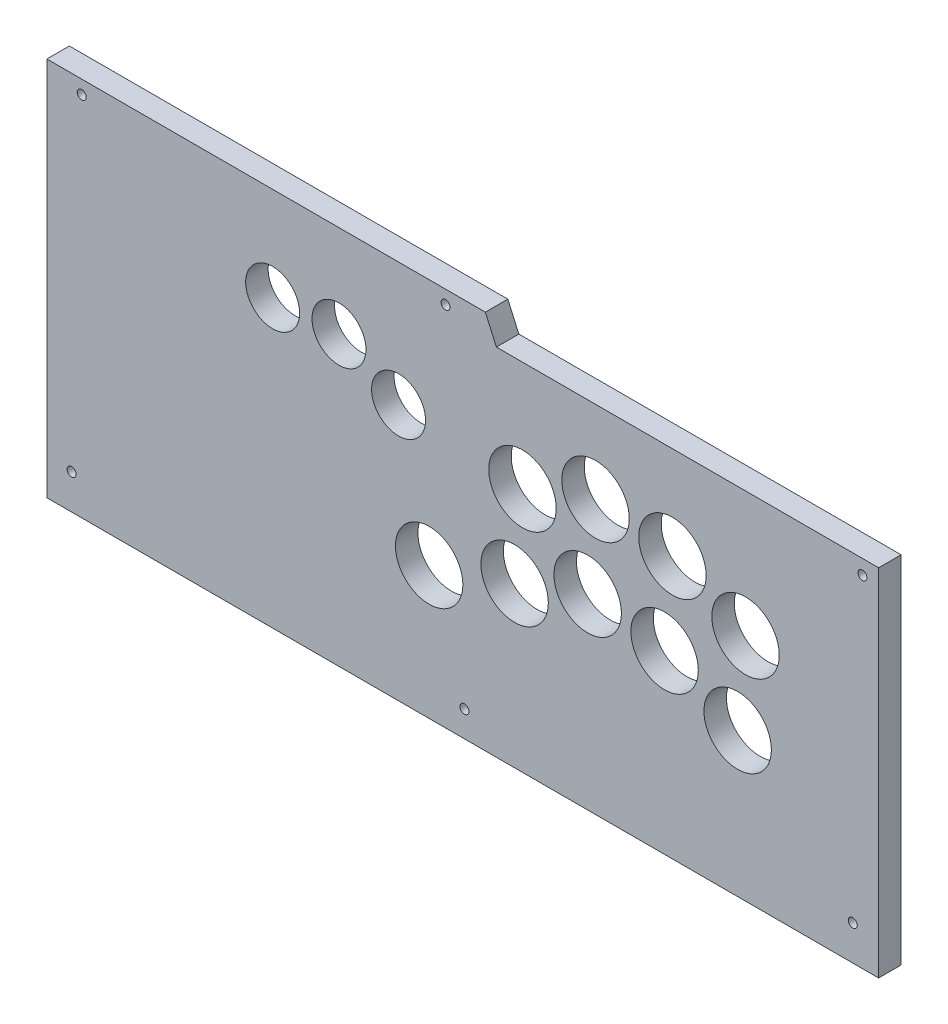
ISO-10303-21;
HEADER;
FILE_DESCRIPTION(('STEP AP214'),'2;1');
FILE_NAME('part.step','',(''),(''),'','','');
FILE_SCHEMA(('AUTOMOTIVE_DESIGN { 1 0 10303 214 1 1 1 1 }'));
ENDSEC;
DATA;
#1=APPLICATION_CONTEXT('core data for automotive mechanical design processes');
#2=APPLICATION_PROTOCOL_DEFINITION('international standard','automotive_design',2000,#1);
#3=PRODUCT_CONTEXT('',#1,'mechanical');
#4=PRODUCT('Part','Part','',(#3));
#5=PRODUCT_RELATED_PRODUCT_CATEGORY('part','',(#4));
#6=PRODUCT_DEFINITION_FORMATION('','',#4);
#7=PRODUCT_DEFINITION_CONTEXT('part definition',#1,'design');
#8=PRODUCT_DEFINITION('design','',#6,#7);
#9=PRODUCT_DEFINITION_SHAPE('','',#8);
#10=(LENGTH_UNIT() NAMED_UNIT(*) SI_UNIT(.MILLI.,.METRE.));
#11=(NAMED_UNIT(*) PLANE_ANGLE_UNIT() SI_UNIT($,.RADIAN.));
#12=(NAMED_UNIT(*) SI_UNIT($,.STERADIAN.) SOLID_ANGLE_UNIT());
#13=UNCERTAINTY_MEASURE_WITH_UNIT(LENGTH_MEASURE(1.E-05),#10,'distance_accuracy_value','');
#14=(GEOMETRIC_REPRESENTATION_CONTEXT(3) GLOBAL_UNCERTAINTY_ASSIGNED_CONTEXT((#13)) GLOBAL_UNIT_ASSIGNED_CONTEXT((#10,
#11,#12)) REPRESENTATION_CONTEXT('',''));
#15=CARTESIAN_POINT('',(0.,0.,0.));
#16=DIRECTION('',(0.,0.,1.));
#17=DIRECTION('',(1.,0.,0.));
#18=AXIS2_PLACEMENT_3D('',#15,#16,#17);
#19=CARTESIAN_POINT('',(184.95,0.,5.));
#20=DIRECTION('',(-1.,0.,0.));
#21=DIRECTION('',(0.,0.,1.));
#22=AXIS2_PLACEMENT_3D('',#19,#20,#21);
#23=PLANE('',#22);
#24=DIRECTION('',(0.,1.,0.));
#25=VECTOR('',#24,1.);
#26=CARTESIAN_POINT('',(184.95,0.,-5.));
#27=LINE('',#26,#25);
#28=CARTESIAN_POINT('',(184.95,0.,-5.));
#29=VERTEX_POINT('',#28);
#30=CARTESIAN_POINT('',(184.95,158.,-5.));
#31=VERTEX_POINT('',#30);
#32=EDGE_CURVE('E128',#29,#31,#27,.T.);
#33=ORIENTED_EDGE('',*,*,#32,.T.);
#34=DIRECTION('',(0.,0.,-1.));
#35=VECTOR('',#34,1.);
#36=CARTESIAN_POINT('',(184.95,158.,5.));
#37=LINE('',#36,#35);
#38=CARTESIAN_POINT('',(184.95,158.,5.));
#39=VERTEX_POINT('',#38);
#40=EDGE_CURVE('E11',#39,#31,#37,.T.);
#41=ORIENTED_EDGE('',*,*,#40,.F.);
#42=DIRECTION('',(0.,1.,0.));
#43=VECTOR('',#42,1.);
#44=CARTESIAN_POINT('',(184.95,0.,5.));
#45=LINE('',#44,#43);
#46=CARTESIAN_POINT('',(184.95,0.,5.));
#47=VERTEX_POINT('',#46);
#48=EDGE_CURVE('E145',#47,#39,#45,.T.);
#49=ORIENTED_EDGE('',*,*,#48,.F.);
#50=DIRECTION('',(0.,0.,-1.));
#51=VECTOR('',#50,1.);
#52=CARTESIAN_POINT('',(184.95,0.,5.));
#53=LINE('',#52,#51);
#54=EDGE_CURVE('E124',#47,#29,#53,.T.);
#55=ORIENTED_EDGE('',*,*,#54,.T.);
#56=EDGE_LOOP('',(#33,#41,#49,#55));
#57=FACE_BOUND('',#56,.T.);
#58=ADVANCED_FACE('F39',(#57),#23,.F.);
#59=CARTESIAN_POINT('',(184.95,158.,5.));
#60=DIRECTION('',(0.,-1.,0.));
#61=DIRECTION('',(1.,0.,0.));
#62=AXIS2_PLACEMENT_3D('',#59,#60,#61);
#63=PLANE('',#62);
#64=DIRECTION('',(-1.,0.,0.));
#65=VECTOR('',#64,1.);
#66=CARTESIAN_POINT('',(184.95,158.,-5.));
#67=LINE('',#66,#65);
#68=CARTESIAN_POINT('',(14.9499999999999,158.,-5.));
#69=VERTEX_POINT('',#68);
#70=EDGE_CURVE('E132',#31,#69,#67,.T.);
#71=ORIENTED_EDGE('',*,*,#70,.T.);
#72=DIRECTION('',(0.,0.,-1.));
#73=VECTOR('',#72,1.);
#74=CARTESIAN_POINT('',(14.9499999999999,158.,5.));
#75=LINE('',#74,#73);
#76=CARTESIAN_POINT('',(14.9499999999999,158.,5.));
#77=VERTEX_POINT('',#76);
#78=EDGE_CURVE('E48',#77,#69,#75,.T.);
#79=ORIENTED_EDGE('',*,*,#78,.F.);
#80=DIRECTION('',(-1.,0.,0.));
#81=VECTOR('',#80,1.);
#82=CARTESIAN_POINT('',(184.95,158.,5.));
#83=LINE('',#82,#81);
#84=EDGE_CURVE('E93',#39,#77,#83,.T.);
#85=ORIENTED_EDGE('',*,*,#84,.F.);
#86=ORIENTED_EDGE('',*,*,#40,.T.);
#87=EDGE_LOOP('',(#71,#79,#85,#86));
#88=FACE_BOUND('',#87,.T.);
#89=ADVANCED_FACE('F174',(#88),#63,.F.);
#90=CARTESIAN_POINT('',(14.9499999999999,158.,5.));
#91=DIRECTION('',(-0.91346878001076,-0.406908820186603,0.));
#92=DIRECTION('',(0.406908820186603,-0.91346878001076,0.));
#93=AXIS2_PLACEMENT_3D('',#90,#91,#92);
#94=PLANE('',#93);
#95=DIRECTION('',(-0.406908820186603,0.91346878001076,0.));
#96=VECTOR('',#95,1.);
#97=CARTESIAN_POINT('',(14.9499999999999,158.,-5.));
#98=LINE('',#97,#96);
#99=CARTESIAN_POINT('',(10.05,169.,-5.));
#100=VERTEX_POINT('',#99);
#101=EDGE_CURVE('E136',#69,#100,#98,.T.);
#102=ORIENTED_EDGE('',*,*,#101,.T.);
#103=DIRECTION('',(0.,0.,-1.));
#104=VECTOR('',#103,1.);
#105=CARTESIAN_POINT('',(10.05,169.,5.));
#106=LINE('',#105,#104);
#107=CARTESIAN_POINT('',(10.05,169.,5.));
#108=VERTEX_POINT('',#107);
#109=EDGE_CURVE('E117',#108,#100,#106,.T.);
#110=ORIENTED_EDGE('',*,*,#109,.F.);
#111=DIRECTION('',(-0.406908820186603,0.91346878001076,0.));
#112=VECTOR('',#111,1.);
#113=CARTESIAN_POINT('',(14.9499999999999,158.,5.));
#114=LINE('',#113,#112);
#115=EDGE_CURVE('E106',#77,#108,#114,.T.);
#116=ORIENTED_EDGE('',*,*,#115,.F.);
#117=ORIENTED_EDGE('',*,*,#78,.T.);
#118=EDGE_LOOP('',(#102,#110,#116,#117));
#119=FACE_BOUND('',#118,.T.);
#120=ADVANCED_FACE('F155',(#119),#94,.F.);
#121=CARTESIAN_POINT('',(10.05,169.,5.));
#122=DIRECTION('',(0.,-1.,0.));
#123=DIRECTION('',(1.,0.,0.));
#124=AXIS2_PLACEMENT_3D('',#121,#122,#123);
#125=PLANE('',#124);
#126=DIRECTION('',(-1.,0.,0.));
#127=VECTOR('',#126,1.);
#128=CARTESIAN_POINT('',(10.05,169.,-5.));
#129=LINE('',#128,#127);
#130=CARTESIAN_POINT('',(-184.95,169.,-5.));
#131=VERTEX_POINT('',#130);
#132=EDGE_CURVE('E115',#100,#131,#129,.T.);
#133=ORIENTED_EDGE('',*,*,#132,.T.);
#134=DIRECTION('',(0.,0.,-1.));
#135=VECTOR('',#134,1.);
#136=CARTESIAN_POINT('',(-184.95,169.,5.));
#137=LINE('',#136,#135);
#138=CARTESIAN_POINT('',(-184.95,169.,5.));
#139=VERTEX_POINT('',#138);
#140=EDGE_CURVE('E112',#139,#131,#137,.T.);
#141=ORIENTED_EDGE('',*,*,#140,.F.);
#142=DIRECTION('',(-1.,0.,0.));
#143=VECTOR('',#142,1.);
#144=CARTESIAN_POINT('',(10.05,169.,5.));
#145=LINE('',#144,#143);
#146=EDGE_CURVE('E100',#108,#139,#145,.T.);
#147=ORIENTED_EDGE('',*,*,#146,.F.);
#148=ORIENTED_EDGE('',*,*,#109,.T.);
#149=EDGE_LOOP('',(#133,#141,#147,#148));
#150=FACE_BOUND('',#149,.T.);
#151=ADVANCED_FACE('F113',(#150),#125,.F.);
#152=CARTESIAN_POINT('',(-184.95,169.,5.));
#153=DIRECTION('',(1.,0.,0.));
#154=DIRECTION('',(0.,1.,0.));
#155=AXIS2_PLACEMENT_3D('',#152,#153,#154);
#156=PLANE('',#155);
#157=DIRECTION('',(0.,-1.,0.));
#158=VECTOR('',#157,1.);
#159=CARTESIAN_POINT('',(-184.95,169.,-5.));
#160=LINE('',#159,#158);
#161=CARTESIAN_POINT('',(-184.95,0.,-5.));
#162=VERTEX_POINT('',#161);
#163=EDGE_CURVE('E79',#131,#162,#160,.T.);
#164=ORIENTED_EDGE('',*,*,#163,.T.);
#165=DIRECTION('',(0.,0.,-1.));
#166=VECTOR('',#165,1.);
#167=CARTESIAN_POINT('',(-184.95,0.,5.));
#168=LINE('',#167,#166);
#169=CARTESIAN_POINT('',(-184.95,0.,5.));
#170=VERTEX_POINT('',#169);
#171=EDGE_CURVE('E118',#170,#162,#168,.T.);
#172=ORIENTED_EDGE('',*,*,#171,.F.);
#173=DIRECTION('',(0.,-1.,0.));
#174=VECTOR('',#173,1.);
#175=CARTESIAN_POINT('',(-184.95,169.,5.));
#176=LINE('',#175,#174);
#177=EDGE_CURVE('E104',#139,#170,#176,.T.);
#178=ORIENTED_EDGE('',*,*,#177,.F.);
#179=ORIENTED_EDGE('',*,*,#140,.T.);
#180=EDGE_LOOP('',(#164,#172,#178,#179));
#181=FACE_BOUND('',#180,.T.);
#182=ADVANCED_FACE('F120',(#181),#156,.F.);
#183=CARTESIAN_POINT('',(-184.95,0.,5.));
#184=DIRECTION('',(0.,1.,0.));
#185=DIRECTION('',(0.,0.,1.));
#186=AXIS2_PLACEMENT_3D('',#183,#184,#185);
#187=PLANE('',#186);
#188=DIRECTION('',(1.,0.,0.));
#189=VECTOR('',#188,1.);
#190=CARTESIAN_POINT('',(-184.95,0.,-5.));
#191=LINE('',#190,#189);
#192=EDGE_CURVE('E85',#162,#29,#191,.T.);
#193=ORIENTED_EDGE('',*,*,#192,.T.);
#194=ORIENTED_EDGE('',*,*,#54,.F.);
#195=DIRECTION('',(1.,0.,0.));
#196=VECTOR('',#195,1.);
#197=CARTESIAN_POINT('',(-184.95,0.,5.));
#198=LINE('',#197,#196);
#199=EDGE_CURVE('E56',#170,#47,#198,.T.);
#200=ORIENTED_EDGE('',*,*,#199,.F.);
#201=ORIENTED_EDGE('',*,*,#171,.T.);
#202=EDGE_LOOP('',(#193,#194,#200,#201));
#203=FACE_BOUND('',#202,.T.);
#204=ADVANCED_FACE('F162',(#203),#187,.F.);
#205=CARTESIAN_POINT('',(0.,0.,5.));
#206=DIRECTION('',(0.,0.,1.));
#207=DIRECTION('',(1.,0.,0.));
#208=AXIS2_PLACEMENT_3D('',#205,#206,#207);
#209=PLANE('',#208);
#210=CARTESIAN_POINT('',(177.75,151.5,5.));
#211=DIRECTION('',(0.,0.,1.));
#212=DIRECTION('',(1.,0.,0.));
#213=AXIS2_PLACEMENT_3D('',#210,#211,#212);
#214=CIRCLE('',#213,2.);
#215=CARTESIAN_POINT('',(179.75,151.5,5.));
#216=VERTEX_POINT('',#215);
#217=EDGE_CURVE('E400',#216,#216,#214,.T.);
#218=ORIENTED_EDGE('',*,*,#217,.F.);
#219=EDGE_LOOP('',(#218));
#220=FACE_BOUND('',#219,.T.);
#221=CARTESIAN_POINT('',(89.7500000000001,78.4000000000001,5.));
#222=DIRECTION('',(0.,0.,1.));
#223=DIRECTION('',(1.,0.,0.));
#224=AXIS2_PLACEMENT_3D('',#221,#222,#223);
#225=CIRCLE('',#224,15.);
#226=CARTESIAN_POINT('',(104.75,78.4000000000001,5.));
#227=VERTEX_POINT('',#226);
#228=EDGE_CURVE('E454',#227,#227,#225,.T.);
#229=ORIENTED_EDGE('',*,*,#228,.F.);
#230=EDGE_LOOP('',(#229));
#231=FACE_BOUND('',#230,.T.);
#232=CARTESIAN_POINT('',(59.05,121.4,5.));
#233=DIRECTION('',(0.,0.,1.));
#234=DIRECTION('',(1.,0.,0.));
#235=AXIS2_PLACEMENT_3D('',#232,#233,#234);
#236=CIRCLE('',#235,15.);
#237=CARTESIAN_POINT('',(74.05,121.4,5.));
#238=VERTEX_POINT('',#237);
#239=EDGE_CURVE('E462',#238,#238,#236,.T.);
#240=ORIENTED_EDGE('',*,*,#239,.F.);
#241=EDGE_LOOP('',(#240));
#242=FACE_BOUND('',#241,.T.);
#243=CARTESIAN_POINT('',(125.75,102.2,5.));
#244=DIRECTION('',(0.,0.,1.));
#245=DIRECTION('',(1.,0.,0.));
#246=AXIS2_PLACEMENT_3D('',#243,#244,#245);
#247=CIRCLE('',#246,15.);
#248=CARTESIAN_POINT('',(140.75,102.2,5.));
#249=VERTEX_POINT('',#248);
#250=EDGE_CURVE('E470',#249,#249,#247,.T.);
#251=ORIENTED_EDGE('',*,*,#250,.F.);
#252=EDGE_LOOP('',(#251));
#253=FACE_BOUND('',#252,.T.);
#254=CARTESIAN_POINT('',(93.2500000000001,116.6,5.));
#255=DIRECTION('',(0.,0.,1.));
#256=DIRECTION('',(1.,0.,0.));
#257=AXIS2_PLACEMENT_3D('',#254,#255,#256);
#258=CIRCLE('',#257,15.);
#259=CARTESIAN_POINT('',(108.25,116.6,5.));
#260=VERTEX_POINT('',#259);
#261=EDGE_CURVE('E478',#260,#260,#258,.T.);
#262=ORIENTED_EDGE('',*,*,#261,.F.);
#263=EDGE_LOOP('',(#262));
#264=FACE_BOUND('',#263,.T.);
#265=CARTESIAN_POINT('',(26.55,109.2,5.));
#266=DIRECTION('',(0.,0.,1.));
#267=DIRECTION('',(1.,0.,0.));
#268=AXIS2_PLACEMENT_3D('',#265,#266,#267);
#269=CIRCLE('',#268,15.);
#270=CARTESIAN_POINT('',(41.55,109.2,5.));
#271=VERTEX_POINT('',#270);
#272=EDGE_CURVE('E425',#271,#271,#269,.T.);
#273=ORIENTED_EDGE('',*,*,#272,.F.);
#274=EDGE_LOOP('',(#273));
#275=FACE_BOUND('',#274,.T.);
#276=CARTESIAN_POINT('',(23.05,71.0000000000001,5.));
#277=DIRECTION('',(0.,0.,1.));
#278=DIRECTION('',(1.,0.,0.));
#279=AXIS2_PLACEMENT_3D('',#276,#277,#278);
#280=CIRCLE('',#279,15.);
#281=CARTESIAN_POINT('',(38.05,71.0000000000001,5.));
#282=VERTEX_POINT('',#281);
#283=EDGE_CURVE('E432',#282,#282,#280,.T.);
#284=ORIENTED_EDGE('',*,*,#283,.F.);
#285=EDGE_LOOP('',(#284));
#286=FACE_BOUND('',#285,.T.);
#287=CARTESIAN_POINT('',(55.55,83.2000000000001,5.));
#288=DIRECTION('',(0.,0.,1.));
#289=DIRECTION('',(1.,0.,0.));
#290=AXIS2_PLACEMENT_3D('',#287,#288,#289);
#291=CIRCLE('',#290,15.);
#292=CARTESIAN_POINT('',(70.55,83.2000000000001,5.));
#293=VERTEX_POINT('',#292);
#294=EDGE_CURVE('E438',#293,#293,#291,.T.);
#295=ORIENTED_EDGE('',*,*,#294,.F.);
#296=EDGE_LOOP('',(#295));
#297=FACE_BOUND('',#296,.T.);
#298=CARTESIAN_POINT('',(122.25,64.0000000000001,5.));
#299=DIRECTION('',(0.,0.,1.));
#300=DIRECTION('',(1.,0.,0.));
#301=AXIS2_PLACEMENT_3D('',#298,#299,#300);
#302=CIRCLE('',#301,15.);
#303=CARTESIAN_POINT('',(137.25,64.0000000000001,5.));
#304=VERTEX_POINT('',#303);
#305=EDGE_CURVE('E446',#304,#304,#302,.T.);
#306=ORIENTED_EDGE('',*,*,#305,.F.);
#307=EDGE_LOOP('',(#306));
#308=FACE_BOUND('',#307,.T.);
#309=CARTESIAN_POINT('',(173.45,15.5,5.));
#310=DIRECTION('',(0.,0.,1.));
#311=DIRECTION('',(1.,0.,0.));
#312=AXIS2_PLACEMENT_3D('',#309,#310,#311);
#313=CIRCLE('',#312,2.);
#314=CARTESIAN_POINT('',(175.45,15.5,5.));
#315=VERTEX_POINT('',#314);
#316=EDGE_CURVE('E404',#315,#315,#313,.T.);
#317=ORIENTED_EDGE('',*,*,#316,.F.);
#318=EDGE_LOOP('',(#317));
#319=FACE_BOUND('',#318,.T.);
#320=CARTESIAN_POINT('',(0.750000000000049,11.5,5.));
#321=DIRECTION('',(0.,0.,1.));
#322=DIRECTION('',(1.,0.,0.));
#323=AXIS2_PLACEMENT_3D('',#320,#321,#322);
#324=CIRCLE('',#323,2.);
#325=CARTESIAN_POINT('',(2.75000000000005,11.5,5.));
#326=VERTEX_POINT('',#325);
#327=EDGE_CURVE('E534',#326,#326,#324,.T.);
#328=ORIENTED_EDGE('',*,*,#327,.F.);
#329=EDGE_LOOP('',(#328));
#330=FACE_BOUND('',#329,.T.);
#331=CARTESIAN_POINT('',(-173.95,15.5,5.));
#332=DIRECTION('',(0.,0.,1.));
#333=DIRECTION('',(1.,0.,0.));
#334=AXIS2_PLACEMENT_3D('',#331,#332,#333);
#335=CIRCLE('',#334,2.);
#336=CARTESIAN_POINT('',(-171.95,15.5,5.));
#337=VERTEX_POINT('',#336);
#338=EDGE_CURVE('E526',#337,#337,#335,.T.);
#339=ORIENTED_EDGE('',*,*,#338,.F.);
#340=EDGE_LOOP('',(#339));
#341=FACE_BOUND('',#340,.T.);
#342=CARTESIAN_POINT('',(-84.55,127.3,5.));
#343=DIRECTION('',(0.,0.,1.));
#344=DIRECTION('',(1.,0.,0.));
#345=AXIS2_PLACEMENT_3D('',#342,#343,#344);
#346=CIRCLE('',#345,12.);
#347=CARTESIAN_POINT('',(-72.55,127.3,5.));
#348=VERTEX_POINT('',#347);
#349=EDGE_CURVE('E518',#348,#348,#346,.T.);
#350=ORIENTED_EDGE('',*,*,#349,.F.);
#351=EDGE_LOOP('',(#350));
#352=FACE_BOUND('',#351,.T.);
#353=CARTESIAN_POINT('',(-169.45,163.,5.));
#354=DIRECTION('',(0.,0.,1.));
#355=DIRECTION('',(1.,0.,0.));
#356=AXIS2_PLACEMENT_3D('',#353,#354,#355);
#357=CIRCLE('',#356,2.);
#358=CARTESIAN_POINT('',(-167.45,163.,5.));
#359=VERTEX_POINT('',#358);
#360=EDGE_CURVE('E510',#359,#359,#357,.T.);
#361=ORIENTED_EDGE('',*,*,#360,.F.);
#362=EDGE_LOOP('',(#361));
#363=FACE_BOUND('',#362,.T.);
#364=CARTESIAN_POINT('',(-7.64999999999997,163.,5.));
#365=DIRECTION('',(0.,0.,1.));
#366=DIRECTION('',(1.,0.,0.));
#367=AXIS2_PLACEMENT_3D('',#364,#365,#366);
#368=CIRCLE('',#367,2.);
#369=CARTESIAN_POINT('',(-5.64999999999997,163.,5.));
#370=VERTEX_POINT('',#369);
#371=EDGE_CURVE('E502',#370,#370,#368,.T.);
#372=ORIENTED_EDGE('',*,*,#371,.F.);
#373=EDGE_LOOP('',(#372));
#374=FACE_BOUND('',#373,.T.);
#375=CARTESIAN_POINT('',(-55.05,128.,5.));
#376=DIRECTION('',(0.,0.,1.));
#377=DIRECTION('',(1.,0.,0.));
#378=AXIS2_PLACEMENT_3D('',#375,#376,#377);
#379=CIRCLE('',#378,12.);
#380=CARTESIAN_POINT('',(-43.05,128.,5.));
#381=VERTEX_POINT('',#380);
#382=EDGE_CURVE('E494',#381,#381,#379,.T.);
#383=ORIENTED_EDGE('',*,*,#382,.F.);
#384=EDGE_LOOP('',(#383));
#385=FACE_BOUND('',#384,.T.);
#386=CARTESIAN_POINT('',(-28.55,114.,5.));
#387=DIRECTION('',(0.,0.,1.));
#388=DIRECTION('',(1.,0.,0.));
#389=AXIS2_PLACEMENT_3D('',#386,#387,#388);
#390=CIRCLE('',#389,12.);
#391=CARTESIAN_POINT('',(-16.55,114.,5.));
#392=VERTEX_POINT('',#391);
#393=EDGE_CURVE('E486',#392,#392,#390,.T.);
#394=ORIENTED_EDGE('',*,*,#393,.F.);
#395=EDGE_LOOP('',(#394));
#396=FACE_BOUND('',#395,.T.);
#397=CARTESIAN_POINT('',(-14.95,59.,5.));
#398=DIRECTION('',(0.,0.,1.));
#399=DIRECTION('',(1.,0.,0.));
#400=AXIS2_PLACEMENT_3D('',#397,#398,#399);
#401=CIRCLE('',#400,15.);
#402=CARTESIAN_POINT('',(0.0500000000000431,59.,5.));
#403=VERTEX_POINT('',#402);
#404=EDGE_CURVE('E410',#403,#403,#401,.T.);
#405=ORIENTED_EDGE('',*,*,#404,.F.);
#406=EDGE_LOOP('',(#405));
#407=FACE_BOUND('',#406,.T.);
#408=ORIENTED_EDGE('',*,*,#48,.T.);
#409=ORIENTED_EDGE('',*,*,#84,.T.);
#410=ORIENTED_EDGE('',*,*,#115,.T.);
#411=ORIENTED_EDGE('',*,*,#146,.T.);
#412=ORIENTED_EDGE('',*,*,#177,.T.);
#413=ORIENTED_EDGE('',*,*,#199,.T.);
#414=EDGE_LOOP('',(#408,#409,#410,#411,#412,#413));
#415=FACE_BOUND('',#414,.T.);
#416=ADVANCED_FACE('F102',(#220,#231,#242,#253,#264,#275,#286,#297,#308,#319,#330,#341,#352,
#363,#374,#385,#396,#407,#415),#209,.T.);
#417=CARTESIAN_POINT('',(0.,0.,-5.));
#418=DIRECTION('',(0.,0.,1.));
#419=DIRECTION('',(1.,0.,0.));
#420=AXIS2_PLACEMENT_3D('',#417,#418,#419);
#421=PLANE('',#420);
#422=CARTESIAN_POINT('',(177.75,151.5,-5.));
#423=DIRECTION('',(0.,0.,1.));
#424=DIRECTION('',(1.,0.,0.));
#425=AXIS2_PLACEMENT_3D('',#422,#423,#424);
#426=CIRCLE('',#425,2.);
#427=CARTESIAN_POINT('',(179.75,151.5,-5.));
#428=VERTEX_POINT('',#427);
#429=EDGE_CURVE('E397',#428,#428,#426,.T.);
#430=ORIENTED_EDGE('',*,*,#429,.T.);
#431=EDGE_LOOP('',(#430));
#432=FACE_BOUND('',#431,.T.);
#433=CARTESIAN_POINT('',(89.7500000000001,78.4000000000001,-5.));
#434=DIRECTION('',(0.,0.,1.));
#435=DIRECTION('',(1.,0.,0.));
#436=AXIS2_PLACEMENT_3D('',#433,#434,#435);
#437=CIRCLE('',#436,15.);
#438=CARTESIAN_POINT('',(104.75,78.4000000000001,-5.));
#439=VERTEX_POINT('',#438);
#440=EDGE_CURVE('E450',#439,#439,#437,.T.);
#441=ORIENTED_EDGE('',*,*,#440,.T.);
#442=EDGE_LOOP('',(#441));
#443=FACE_BOUND('',#442,.T.);
#444=CARTESIAN_POINT('',(59.05,121.4,-5.));
#445=DIRECTION('',(0.,0.,1.));
#446=DIRECTION('',(1.,0.,0.));
#447=AXIS2_PLACEMENT_3D('',#444,#445,#446);
#448=CIRCLE('',#447,15.);
#449=CARTESIAN_POINT('',(74.05,121.4,-5.));
#450=VERTEX_POINT('',#449);
#451=EDGE_CURVE('E458',#450,#450,#448,.T.);
#452=ORIENTED_EDGE('',*,*,#451,.T.);
#453=EDGE_LOOP('',(#452));
#454=FACE_BOUND('',#453,.T.);
#455=CARTESIAN_POINT('',(125.75,102.2,-5.));
#456=DIRECTION('',(0.,0.,1.));
#457=DIRECTION('',(1.,0.,0.));
#458=AXIS2_PLACEMENT_3D('',#455,#456,#457);
#459=CIRCLE('',#458,15.);
#460=CARTESIAN_POINT('',(140.75,102.2,-5.));
#461=VERTEX_POINT('',#460);
#462=EDGE_CURVE('E466',#461,#461,#459,.T.);
#463=ORIENTED_EDGE('',*,*,#462,.T.);
#464=EDGE_LOOP('',(#463));
#465=FACE_BOUND('',#464,.T.);
#466=CARTESIAN_POINT('',(93.2500000000001,116.6,-5.));
#467=DIRECTION('',(0.,0.,1.));
#468=DIRECTION('',(1.,0.,0.));
#469=AXIS2_PLACEMENT_3D('',#466,#467,#468);
#470=CIRCLE('',#469,15.);
#471=CARTESIAN_POINT('',(108.25,116.6,-5.));
#472=VERTEX_POINT('',#471);
#473=EDGE_CURVE('E474',#472,#472,#470,.T.);
#474=ORIENTED_EDGE('',*,*,#473,.T.);
#475=EDGE_LOOP('',(#474));
#476=FACE_BOUND('',#475,.T.);
#477=CARTESIAN_POINT('',(26.55,109.2,-5.));
#478=DIRECTION('',(0.,0.,1.));
#479=DIRECTION('',(1.,0.,0.));
#480=AXIS2_PLACEMENT_3D('',#477,#478,#479);
#481=CIRCLE('',#480,15.);
#482=CARTESIAN_POINT('',(41.55,109.2,-5.));
#483=VERTEX_POINT('',#482);
#484=EDGE_CURVE('E414',#483,#483,#481,.T.);
#485=ORIENTED_EDGE('',*,*,#484,.T.);
#486=EDGE_LOOP('',(#485));
#487=FACE_BOUND('',#486,.T.);
#488=CARTESIAN_POINT('',(23.05,71.0000000000001,-5.));
#489=DIRECTION('',(0.,0.,1.));
#490=DIRECTION('',(1.,0.,0.));
#491=AXIS2_PLACEMENT_3D('',#488,#489,#490);
#492=CIRCLE('',#491,15.);
#493=CARTESIAN_POINT('',(38.05,71.0000000000001,-5.));
#494=VERTEX_POINT('',#493);
#495=EDGE_CURVE('E407',#494,#494,#492,.T.);
#496=ORIENTED_EDGE('',*,*,#495,.T.);
#497=EDGE_LOOP('',(#496));
#498=FACE_BOUND('',#497,.T.);
#499=CARTESIAN_POINT('',(55.55,83.2000000000001,-5.));
#500=DIRECTION('',(0.,0.,1.));
#501=DIRECTION('',(1.,0.,0.));
#502=AXIS2_PLACEMENT_3D('',#499,#500,#501);
#503=CIRCLE('',#502,15.);
#504=CARTESIAN_POINT('',(70.55,83.2000000000001,-5.));
#505=VERTEX_POINT('',#504);
#506=EDGE_CURVE('E435',#505,#505,#503,.T.);
#507=ORIENTED_EDGE('',*,*,#506,.T.);
#508=EDGE_LOOP('',(#507));
#509=FACE_BOUND('',#508,.T.);
#510=CARTESIAN_POINT('',(122.25,64.0000000000001,-5.));
#511=DIRECTION('',(0.,0.,1.));
#512=DIRECTION('',(1.,0.,0.));
#513=AXIS2_PLACEMENT_3D('',#510,#511,#512);
#514=CIRCLE('',#513,15.);
#515=CARTESIAN_POINT('',(137.25,64.0000000000001,-5.));
#516=VERTEX_POINT('',#515);
#517=EDGE_CURVE('E442',#516,#516,#514,.T.);
#518=ORIENTED_EDGE('',*,*,#517,.T.);
#519=EDGE_LOOP('',(#518));
#520=FACE_BOUND('',#519,.T.);
#521=CARTESIAN_POINT('',(173.45,15.5,-5.));
#522=DIRECTION('',(0.,0.,1.));
#523=DIRECTION('',(1.,0.,0.));
#524=AXIS2_PLACEMENT_3D('',#521,#522,#523);
#525=CIRCLE('',#524,2.);
#526=CARTESIAN_POINT('',(175.45,15.5,-5.));
#527=VERTEX_POINT('',#526);
#528=EDGE_CURVE('E538',#527,#527,#525,.T.);
#529=ORIENTED_EDGE('',*,*,#528,.T.);
#530=EDGE_LOOP('',(#529));
#531=FACE_BOUND('',#530,.T.);
#532=CARTESIAN_POINT('',(0.750000000000049,11.5,-5.));
#533=DIRECTION('',(0.,0.,1.));
#534=DIRECTION('',(1.,0.,0.));
#535=AXIS2_PLACEMENT_3D('',#532,#533,#534);
#536=CIRCLE('',#535,2.);
#537=CARTESIAN_POINT('',(2.75000000000005,11.5,-5.));
#538=VERTEX_POINT('',#537);
#539=EDGE_CURVE('E530',#538,#538,#536,.T.);
#540=ORIENTED_EDGE('',*,*,#539,.T.);
#541=EDGE_LOOP('',(#540));
#542=FACE_BOUND('',#541,.T.);
#543=CARTESIAN_POINT('',(-173.95,15.5,-5.));
#544=DIRECTION('',(0.,0.,1.));
#545=DIRECTION('',(1.,0.,0.));
#546=AXIS2_PLACEMENT_3D('',#543,#544,#545);
#547=CIRCLE('',#546,2.);
#548=CARTESIAN_POINT('',(-171.95,15.5,-5.));
#549=VERTEX_POINT('',#548);
#550=EDGE_CURVE('E522',#549,#549,#547,.T.);
#551=ORIENTED_EDGE('',*,*,#550,.T.);
#552=EDGE_LOOP('',(#551));
#553=FACE_BOUND('',#552,.T.);
#554=CARTESIAN_POINT('',(-84.55,127.3,-5.));
#555=DIRECTION('',(0.,0.,1.));
#556=DIRECTION('',(1.,0.,0.));
#557=AXIS2_PLACEMENT_3D('',#554,#555,#556);
#558=CIRCLE('',#557,12.);
#559=CARTESIAN_POINT('',(-72.55,127.3,-5.));
#560=VERTEX_POINT('',#559);
#561=EDGE_CURVE('E514',#560,#560,#558,.T.);
#562=ORIENTED_EDGE('',*,*,#561,.T.);
#563=EDGE_LOOP('',(#562));
#564=FACE_BOUND('',#563,.T.);
#565=CARTESIAN_POINT('',(-169.45,163.,-5.));
#566=DIRECTION('',(0.,0.,1.));
#567=DIRECTION('',(1.,0.,0.));
#568=AXIS2_PLACEMENT_3D('',#565,#566,#567);
#569=CIRCLE('',#568,2.);
#570=CARTESIAN_POINT('',(-167.45,163.,-5.));
#571=VERTEX_POINT('',#570);
#572=EDGE_CURVE('E506',#571,#571,#569,.T.);
#573=ORIENTED_EDGE('',*,*,#572,.T.);
#574=EDGE_LOOP('',(#573));
#575=FACE_BOUND('',#574,.T.);
#576=CARTESIAN_POINT('',(-7.64999999999997,163.,-5.));
#577=DIRECTION('',(0.,0.,1.));
#578=DIRECTION('',(1.,0.,0.));
#579=AXIS2_PLACEMENT_3D('',#576,#577,#578);
#580=CIRCLE('',#579,2.);
#581=CARTESIAN_POINT('',(-5.64999999999997,163.,-5.));
#582=VERTEX_POINT('',#581);
#583=EDGE_CURVE('E498',#582,#582,#580,.T.);
#584=ORIENTED_EDGE('',*,*,#583,.T.);
#585=EDGE_LOOP('',(#584));
#586=FACE_BOUND('',#585,.T.);
#587=CARTESIAN_POINT('',(-55.05,128.,-5.));
#588=DIRECTION('',(0.,0.,1.));
#589=DIRECTION('',(1.,0.,0.));
#590=AXIS2_PLACEMENT_3D('',#587,#588,#589);
#591=CIRCLE('',#590,12.);
#592=CARTESIAN_POINT('',(-43.05,128.,-5.));
#593=VERTEX_POINT('',#592);
#594=EDGE_CURVE('E490',#593,#593,#591,.T.);
#595=ORIENTED_EDGE('',*,*,#594,.T.);
#596=EDGE_LOOP('',(#595));
#597=FACE_BOUND('',#596,.T.);
#598=CARTESIAN_POINT('',(-28.55,114.,-5.));
#599=DIRECTION('',(0.,0.,1.));
#600=DIRECTION('',(1.,0.,0.));
#601=AXIS2_PLACEMENT_3D('',#598,#599,#600);
#602=CIRCLE('',#601,12.);
#603=CARTESIAN_POINT('',(-16.55,114.,-5.));
#604=VERTEX_POINT('',#603);
#605=EDGE_CURVE('E482',#604,#604,#602,.T.);
#606=ORIENTED_EDGE('',*,*,#605,.T.);
#607=EDGE_LOOP('',(#606));
#608=FACE_BOUND('',#607,.T.);
#609=CARTESIAN_POINT('',(-14.95,59.,-5.));
#610=DIRECTION('',(0.,0.,1.));
#611=DIRECTION('',(1.,0.,0.));
#612=AXIS2_PLACEMENT_3D('',#609,#610,#611);
#613=CIRCLE('',#612,15.);
#614=CARTESIAN_POINT('',(0.0500000000000431,59.,-5.));
#615=VERTEX_POINT('',#614);
#616=EDGE_CURVE('E133',#615,#615,#613,.T.);
#617=ORIENTED_EDGE('',*,*,#616,.T.);
#618=EDGE_LOOP('',(#617));
#619=FACE_BOUND('',#618,.T.);
#620=ORIENTED_EDGE('',*,*,#32,.F.);
#621=ORIENTED_EDGE('',*,*,#192,.F.);
#622=ORIENTED_EDGE('',*,*,#163,.F.);
#623=ORIENTED_EDGE('',*,*,#132,.F.);
#624=ORIENTED_EDGE('',*,*,#101,.F.);
#625=ORIENTED_EDGE('',*,*,#70,.F.);
#626=EDGE_LOOP('',(#620,#621,#622,#623,#624,#625));
#627=FACE_BOUND('',#626,.T.);
#628=ADVANCED_FACE('F158',(#432,#443,#454,#465,#476,#487,#498,#509,#520,#531,#542,#553,#564,
#575,#586,#597,#608,#619,#627),#421,.F.);
#629=CARTESIAN_POINT('',(-14.95,59.,-5.));
#630=DIRECTION('',(0.,0.,1.));
#631=DIRECTION('',(1.,0.,0.));
#632=AXIS2_PLACEMENT_3D('',#629,#630,#631);
#633=CYLINDRICAL_SURFACE('',#632,15.);
#634=ORIENTED_EDGE('',*,*,#616,.F.);
#635=EDGE_LOOP('',(#634));
#636=FACE_BOUND('',#635,.T.);
#637=ORIENTED_EDGE('',*,*,#404,.T.);
#638=EDGE_LOOP('',(#637));
#639=FACE_BOUND('',#638,.T.);
#640=ADVANCED_FACE('F211',(#636,#639),#633,.F.);
#641=CARTESIAN_POINT('',(-28.55,114.,-5.));
#642=DIRECTION('',(0.,0.,1.));
#643=DIRECTION('',(1.,0.,0.));
#644=AXIS2_PLACEMENT_3D('',#641,#642,#643);
#645=CYLINDRICAL_SURFACE('',#644,12.);
#646=ORIENTED_EDGE('',*,*,#605,.F.);
#647=EDGE_LOOP('',(#646));
#648=FACE_BOUND('',#647,.T.);
#649=ORIENTED_EDGE('',*,*,#393,.T.);
#650=EDGE_LOOP('',(#649));
#651=FACE_BOUND('',#650,.T.);
#652=ADVANCED_FACE('F220',(#648,#651),#645,.F.);
#653=CARTESIAN_POINT('',(-55.05,128.,-5.));
#654=DIRECTION('',(0.,0.,1.));
#655=DIRECTION('',(1.,0.,0.));
#656=AXIS2_PLACEMENT_3D('',#653,#654,#655);
#657=CYLINDRICAL_SURFACE('',#656,12.);
#658=ORIENTED_EDGE('',*,*,#594,.F.);
#659=EDGE_LOOP('',(#658));
#660=FACE_BOUND('',#659,.T.);
#661=ORIENTED_EDGE('',*,*,#382,.T.);
#662=EDGE_LOOP('',(#661));
#663=FACE_BOUND('',#662,.T.);
#664=ADVANCED_FACE('F230',(#660,#663),#657,.F.);
#665=CARTESIAN_POINT('',(-7.64999999999997,163.,-5.));
#666=DIRECTION('',(0.,0.,1.));
#667=DIRECTION('',(1.,0.,0.));
#668=AXIS2_PLACEMENT_3D('',#665,#666,#667);
#669=CYLINDRICAL_SURFACE('',#668,2.);
#670=ORIENTED_EDGE('',*,*,#583,.F.);
#671=EDGE_LOOP('',(#670));
#672=FACE_BOUND('',#671,.T.);
#673=ORIENTED_EDGE('',*,*,#371,.T.);
#674=EDGE_LOOP('',(#673));
#675=FACE_BOUND('',#674,.T.);
#676=ADVANCED_FACE('F240',(#672,#675),#669,.F.);
#677=CARTESIAN_POINT('',(-169.45,163.,-5.));
#678=DIRECTION('',(0.,0.,1.));
#679=DIRECTION('',(1.,0.,0.));
#680=AXIS2_PLACEMENT_3D('',#677,#678,#679);
#681=CYLINDRICAL_SURFACE('',#680,2.);
#682=ORIENTED_EDGE('',*,*,#572,.F.);
#683=EDGE_LOOP('',(#682));
#684=FACE_BOUND('',#683,.T.);
#685=ORIENTED_EDGE('',*,*,#360,.T.);
#686=EDGE_LOOP('',(#685));
#687=FACE_BOUND('',#686,.T.);
#688=ADVANCED_FACE('F250',(#684,#687),#681,.F.);
#689=CARTESIAN_POINT('',(-84.55,127.3,-5.));
#690=DIRECTION('',(0.,0.,1.));
#691=DIRECTION('',(1.,0.,0.));
#692=AXIS2_PLACEMENT_3D('',#689,#690,#691);
#693=CYLINDRICAL_SURFACE('',#692,12.);
#694=ORIENTED_EDGE('',*,*,#561,.F.);
#695=EDGE_LOOP('',(#694));
#696=FACE_BOUND('',#695,.T.);
#697=ORIENTED_EDGE('',*,*,#349,.T.);
#698=EDGE_LOOP('',(#697));
#699=FACE_BOUND('',#698,.T.);
#700=ADVANCED_FACE('F260',(#696,#699),#693,.F.);
#701=CARTESIAN_POINT('',(-173.95,15.5,-5.));
#702=DIRECTION('',(0.,0.,1.));
#703=DIRECTION('',(1.,0.,0.));
#704=AXIS2_PLACEMENT_3D('',#701,#702,#703);
#705=CYLINDRICAL_SURFACE('',#704,2.);
#706=ORIENTED_EDGE('',*,*,#550,.F.);
#707=EDGE_LOOP('',(#706));
#708=FACE_BOUND('',#707,.T.);
#709=ORIENTED_EDGE('',*,*,#338,.T.);
#710=EDGE_LOOP('',(#709));
#711=FACE_BOUND('',#710,.T.);
#712=ADVANCED_FACE('F270',(#708,#711),#705,.F.);
#713=CARTESIAN_POINT('',(0.750000000000049,11.5,-5.));
#714=DIRECTION('',(0.,0.,1.));
#715=DIRECTION('',(1.,0.,0.));
#716=AXIS2_PLACEMENT_3D('',#713,#714,#715);
#717=CYLINDRICAL_SURFACE('',#716,2.);
#718=ORIENTED_EDGE('',*,*,#539,.F.);
#719=EDGE_LOOP('',(#718));
#720=FACE_BOUND('',#719,.T.);
#721=ORIENTED_EDGE('',*,*,#327,.T.);
#722=EDGE_LOOP('',(#721));
#723=FACE_BOUND('',#722,.T.);
#724=ADVANCED_FACE('F280',(#720,#723),#717,.F.);
#725=CARTESIAN_POINT('',(173.45,15.5,-5.));
#726=DIRECTION('',(0.,0.,1.));
#727=DIRECTION('',(1.,0.,0.));
#728=AXIS2_PLACEMENT_3D('',#725,#726,#727);
#729=CYLINDRICAL_SURFACE('',#728,2.);
#730=ORIENTED_EDGE('',*,*,#528,.F.);
#731=EDGE_LOOP('',(#730));
#732=FACE_BOUND('',#731,.T.);
#733=ORIENTED_EDGE('',*,*,#316,.T.);
#734=EDGE_LOOP('',(#733));
#735=FACE_BOUND('',#734,.T.);
#736=ADVANCED_FACE('F290',(#732,#735),#729,.F.);
#737=CARTESIAN_POINT('',(122.25,64.0000000000001,-5.));
#738=DIRECTION('',(0.,0.,1.));
#739=DIRECTION('',(1.,0.,0.));
#740=AXIS2_PLACEMENT_3D('',#737,#738,#739);
#741=CYLINDRICAL_SURFACE('',#740,15.);
#742=ORIENTED_EDGE('',*,*,#517,.F.);
#743=EDGE_LOOP('',(#742));
#744=FACE_BOUND('',#743,.T.);
#745=ORIENTED_EDGE('',*,*,#305,.T.);
#746=EDGE_LOOP('',(#745));
#747=FACE_BOUND('',#746,.T.);
#748=ADVANCED_FACE('F300',(#744,#747),#741,.F.);
#749=CARTESIAN_POINT('',(55.55,83.2000000000001,-5.));
#750=DIRECTION('',(0.,0.,1.));
#751=DIRECTION('',(1.,0.,0.));
#752=AXIS2_PLACEMENT_3D('',#749,#750,#751);
#753=CYLINDRICAL_SURFACE('',#752,15.);
#754=ORIENTED_EDGE('',*,*,#506,.F.);
#755=EDGE_LOOP('',(#754));
#756=FACE_BOUND('',#755,.T.);
#757=ORIENTED_EDGE('',*,*,#294,.T.);
#758=EDGE_LOOP('',(#757));
#759=FACE_BOUND('',#758,.T.);
#760=ADVANCED_FACE('F310',(#756,#759),#753,.F.);
#761=CARTESIAN_POINT('',(23.05,71.0000000000001,-5.));
#762=DIRECTION('',(0.,0.,1.));
#763=DIRECTION('',(1.,0.,0.));
#764=AXIS2_PLACEMENT_3D('',#761,#762,#763);
#765=CYLINDRICAL_SURFACE('',#764,15.);
#766=ORIENTED_EDGE('',*,*,#495,.F.);
#767=EDGE_LOOP('',(#766));
#768=FACE_BOUND('',#767,.T.);
#769=ORIENTED_EDGE('',*,*,#283,.T.);
#770=EDGE_LOOP('',(#769));
#771=FACE_BOUND('',#770,.T.);
#772=ADVANCED_FACE('F320',(#768,#771),#765,.F.);
#773=CARTESIAN_POINT('',(26.55,109.2,-5.));
#774=DIRECTION('',(0.,0.,1.));
#775=DIRECTION('',(1.,0.,0.));
#776=AXIS2_PLACEMENT_3D('',#773,#774,#775);
#777=CYLINDRICAL_SURFACE('',#776,15.);
#778=ORIENTED_EDGE('',*,*,#484,.F.);
#779=EDGE_LOOP('',(#778));
#780=FACE_BOUND('',#779,.T.);
#781=ORIENTED_EDGE('',*,*,#272,.T.);
#782=EDGE_LOOP('',(#781));
#783=FACE_BOUND('',#782,.T.);
#784=ADVANCED_FACE('F330',(#780,#783),#777,.F.);
#785=CARTESIAN_POINT('',(93.2500000000001,116.6,-5.));
#786=DIRECTION('',(0.,0.,1.));
#787=DIRECTION('',(1.,0.,0.));
#788=AXIS2_PLACEMENT_3D('',#785,#786,#787);
#789=CYLINDRICAL_SURFACE('',#788,15.);
#790=ORIENTED_EDGE('',*,*,#473,.F.);
#791=EDGE_LOOP('',(#790));
#792=FACE_BOUND('',#791,.T.);
#793=ORIENTED_EDGE('',*,*,#261,.T.);
#794=EDGE_LOOP('',(#793));
#795=FACE_BOUND('',#794,.T.);
#796=ADVANCED_FACE('F340',(#792,#795),#789,.F.);
#797=CARTESIAN_POINT('',(125.75,102.2,-5.));
#798=DIRECTION('',(0.,0.,1.));
#799=DIRECTION('',(1.,0.,0.));
#800=AXIS2_PLACEMENT_3D('',#797,#798,#799);
#801=CYLINDRICAL_SURFACE('',#800,15.);
#802=ORIENTED_EDGE('',*,*,#462,.F.);
#803=EDGE_LOOP('',(#802));
#804=FACE_BOUND('',#803,.T.);
#805=ORIENTED_EDGE('',*,*,#250,.T.);
#806=EDGE_LOOP('',(#805));
#807=FACE_BOUND('',#806,.T.);
#808=ADVANCED_FACE('F350',(#804,#807),#801,.F.);
#809=CARTESIAN_POINT('',(59.05,121.4,-5.));
#810=DIRECTION('',(0.,0.,1.));
#811=DIRECTION('',(1.,0.,0.));
#812=AXIS2_PLACEMENT_3D('',#809,#810,#811);
#813=CYLINDRICAL_SURFACE('',#812,15.);
#814=ORIENTED_EDGE('',*,*,#451,.F.);
#815=EDGE_LOOP('',(#814));
#816=FACE_BOUND('',#815,.T.);
#817=ORIENTED_EDGE('',*,*,#239,.T.);
#818=EDGE_LOOP('',(#817));
#819=FACE_BOUND('',#818,.T.);
#820=ADVANCED_FACE('F360',(#816,#819),#813,.F.);
#821=CARTESIAN_POINT('',(89.7500000000001,78.4000000000001,-5.));
#822=DIRECTION('',(0.,0.,1.));
#823=DIRECTION('',(1.,0.,0.));
#824=AXIS2_PLACEMENT_3D('',#821,#822,#823);
#825=CYLINDRICAL_SURFACE('',#824,15.);
#826=ORIENTED_EDGE('',*,*,#440,.F.);
#827=EDGE_LOOP('',(#826));
#828=FACE_BOUND('',#827,.T.);
#829=ORIENTED_EDGE('',*,*,#228,.T.);
#830=EDGE_LOOP('',(#829));
#831=FACE_BOUND('',#830,.T.);
#832=ADVANCED_FACE('F370',(#828,#831),#825,.F.);
#833=CARTESIAN_POINT('',(177.75,151.5,-5.));
#834=DIRECTION('',(0.,0.,1.));
#835=DIRECTION('',(1.,0.,0.));
#836=AXIS2_PLACEMENT_3D('',#833,#834,#835);
#837=CYLINDRICAL_SURFACE('',#836,2.);
#838=ORIENTED_EDGE('',*,*,#429,.F.);
#839=EDGE_LOOP('',(#838));
#840=FACE_BOUND('',#839,.T.);
#841=ORIENTED_EDGE('',*,*,#217,.T.);
#842=EDGE_LOOP('',(#841));
#843=FACE_BOUND('',#842,.T.);
#844=ADVANCED_FACE('F380',(#840,#843),#837,.F.);
#845=CLOSED_SHELL('',(#58,#89,#120,#151,#182,#204,#416,#628,#640,#652,#664,#676,#688,#700,#712,
#724,#736,#748,#760,#772,#784,#796,#808,#820,#832,#844));
#846=MANIFOLD_SOLID_BREP('B2',#845);
#847=ADVANCED_BREP_SHAPE_REPRESENTATION('',(#18,#846),#14);
#848=SHAPE_DEFINITION_REPRESENTATION(#9,#847);
ENDSEC;
END-ISO-10303-21;
